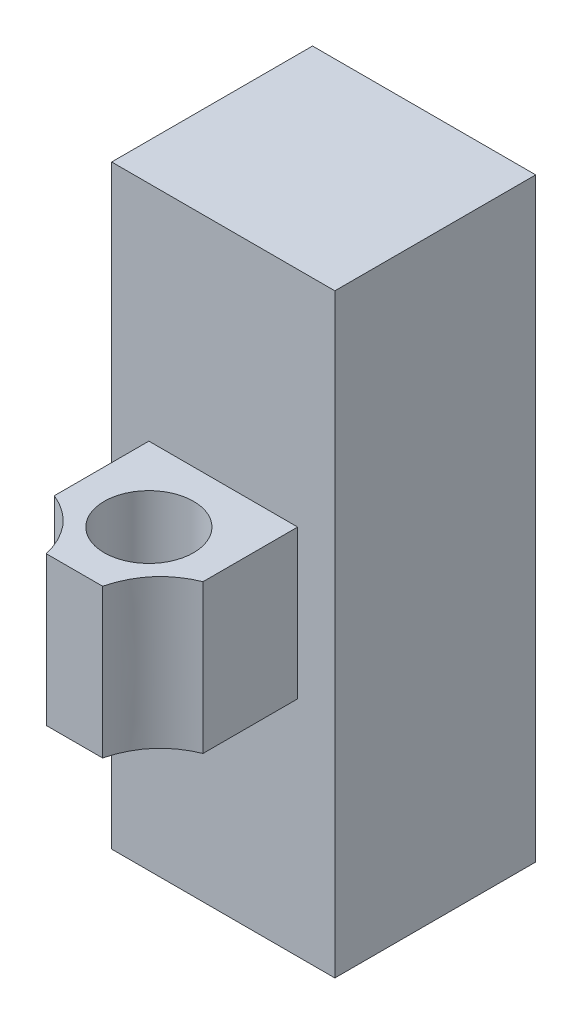
ISO-10303-21;
HEADER;
FILE_DESCRIPTION(('STEP AP214'),'2;1');
FILE_NAME('part.step','',(''),(''),'','','');
FILE_SCHEMA(('AUTOMOTIVE_DESIGN { 1 0 10303 214 1 1 1 1 }'));
ENDSEC;
DATA;
#1=APPLICATION_CONTEXT('core data for automotive mechanical design processes');
#2=APPLICATION_PROTOCOL_DEFINITION('international standard','automotive_design',2000,#1);
#3=PRODUCT_CONTEXT('',#1,'mechanical');
#4=PRODUCT('Part','Part','',(#3));
#5=PRODUCT_RELATED_PRODUCT_CATEGORY('part','',(#4));
#6=PRODUCT_DEFINITION_FORMATION('','',#4);
#7=PRODUCT_DEFINITION_CONTEXT('part definition',#1,'design');
#8=PRODUCT_DEFINITION('design','',#6,#7);
#9=PRODUCT_DEFINITION_SHAPE('','',#8);
#10=(LENGTH_UNIT() NAMED_UNIT(*) SI_UNIT(.MILLI.,.METRE.));
#11=(NAMED_UNIT(*) PLANE_ANGLE_UNIT() SI_UNIT($,.RADIAN.));
#12=(NAMED_UNIT(*) SI_UNIT($,.STERADIAN.) SOLID_ANGLE_UNIT());
#13=UNCERTAINTY_MEASURE_WITH_UNIT(LENGTH_MEASURE(1.E-05),#10,'distance_accuracy_value','');
#14=(GEOMETRIC_REPRESENTATION_CONTEXT(3) GLOBAL_UNCERTAINTY_ASSIGNED_CONTEXT((#13)) GLOBAL_UNIT_ASSIGNED_CONTEXT((#10,
#11,#12)) REPRESENTATION_CONTEXT('',''));
#15=CARTESIAN_POINT('',(0.,0.,0.));
#16=DIRECTION('',(0.,0.,1.));
#17=DIRECTION('',(1.,0.,0.));
#18=AXIS2_PLACEMENT_3D('',#15,#16,#17);
#19=CARTESIAN_POINT('',(10.,-10.,20.));
#20=DIRECTION('',(-1.,0.,0.));
#21=DIRECTION('',(0.,0.,1.));
#22=AXIS2_PLACEMENT_3D('',#19,#20,#21);
#23=PLANE('',#22);
#24=DIRECTION('',(0.,0.,-1.));
#25=VECTOR('',#24,1.);
#26=CARTESIAN_POINT('',(10.,10.,20.));
#27=LINE('',#26,#25);
#28=CARTESIAN_POINT('',(10.,10.,12.7143181142646));
#29=VERTEX_POINT('',#28);
#30=CARTESIAN_POINT('',(10.,10.,0.));
#31=VERTEX_POINT('',#30);
#32=EDGE_CURVE('E11',#29,#31,#27,.T.);
#33=ORIENTED_EDGE('',*,*,#32,.F.);
#34=DIRECTION('',(0.,1.,0.));
#35=VECTOR('',#34,1.);
#36=CARTESIAN_POINT('',(10.,-10.,12.7143181142646));
#37=LINE('',#36,#35);
#38=CARTESIAN_POINT('',(10.,-10.,12.7143181142646));
#39=VERTEX_POINT('',#38);
#40=EDGE_CURVE('E142',#39,#29,#37,.T.);
#41=ORIENTED_EDGE('',*,*,#40,.F.);
#42=DIRECTION('',(0.,0.,-1.));
#43=VECTOR('',#42,1.);
#44=CARTESIAN_POINT('',(10.,-10.,20.));
#45=LINE('',#44,#43);
#46=CARTESIAN_POINT('',(10.,-10.,0.));
#47=VERTEX_POINT('',#46);
#48=EDGE_CURVE('E201',#39,#47,#45,.T.);
#49=ORIENTED_EDGE('',*,*,#48,.T.);
#50=DIRECTION('',(0.,1.,0.));
#51=VECTOR('',#50,1.);
#52=CARTESIAN_POINT('',(10.,-10.,0.));
#53=LINE('',#52,#51);
#54=EDGE_CURVE('E189',#47,#31,#53,.T.);
#55=ORIENTED_EDGE('',*,*,#54,.T.);
#56=EDGE_LOOP('',(#33,#41,#49,#55));
#57=FACE_BOUND('',#56,.T.);
#58=ADVANCED_FACE('F41',(#57),#23,.F.);
#59=CARTESIAN_POINT('',(-10.,10.,20.));
#60=DIRECTION('',(0.,-1.,0.));
#61=DIRECTION('',(0.,0.,-1.));
#62=AXIS2_PLACEMENT_3D('',#59,#60,#61);
#63=PLANE('',#62);
#64=CARTESIAN_POINT('',(0.,10.,10.));
#65=DIRECTION('',(0.,1.,0.));
#66=DIRECTION('',(0.,0.,1.));
#67=AXIS2_PLACEMENT_3D('',#64,#65,#66);
#68=CIRCLE('',#67,6.);
#69=CARTESIAN_POINT('',(0.,10.,16.));
#70=VERTEX_POINT('',#69);
#71=EDGE_CURVE('E190',#70,#70,#68,.T.);
#72=ORIENTED_EDGE('',*,*,#71,.F.);
#73=EDGE_LOOP('',(#72));
#74=FACE_BOUND('',#73,.T.);
#75=DIRECTION('',(0.,0.,-1.));
#76=VECTOR('',#75,1.);
#77=CARTESIAN_POINT('',(-10.,10.,20.));
#78=LINE('',#77,#76);
#79=CARTESIAN_POINT('',(-10.,10.,12.7143181142646));
#80=VERTEX_POINT('',#79);
#81=CARTESIAN_POINT('',(-10.,10.,0.));
#82=VERTEX_POINT('',#81);
#83=EDGE_CURVE('E48',#80,#82,#78,.T.);
#84=ORIENTED_EDGE('',*,*,#83,.F.);
#85=CARTESIAN_POINT('',(-3.78828258809806,10.,20.));
#86=CARTESIAN_POINT('',(-5.11271472694849,10.,14.756625636237));
#87=CARTESIAN_POINT('',(-10.,10.,12.7143181142646));
#88=B_SPLINE_CURVE_WITH_KNOTS('',2,(#85,#86,#87),.UNSPECIFIED.,.F.,.F.,(3,3),(0.,1.),.UNSPECIFIED.);
#89=CARTESIAN_POINT('',(-3.78828258809806,10.,20.));
#90=VERTEX_POINT('',#89);
#91=EDGE_CURVE('E155',#90,#80,#88,.T.);
#92=ORIENTED_EDGE('',*,*,#91,.F.);
#93=DIRECTION('',(-1.,0.,0.));
#94=VECTOR('',#93,1.);
#95=CARTESIAN_POINT('',(-10.,10.,20.));
#96=LINE('',#95,#94);
#97=CARTESIAN_POINT('',(3.78828258809806,10.,20.));
#98=VERTEX_POINT('',#97);
#99=EDGE_CURVE('E194',#98,#90,#96,.T.);
#100=ORIENTED_EDGE('',*,*,#99,.F.);
#101=CARTESIAN_POINT('',(10.,10.,12.7143181142646));
#102=CARTESIAN_POINT('',(5.11271472694849,10.,14.756625636237));
#103=CARTESIAN_POINT('',(3.78828258809807,10.,20.));
#104=B_SPLINE_CURVE_WITH_KNOTS('',2,(#101,#102,#103),.UNSPECIFIED.,.F.,.F.,(3,3),(0.,1.),.UNSPECIFIED.);
#105=EDGE_CURVE('E63',#29,#98,#104,.T.);
#106=ORIENTED_EDGE('',*,*,#105,.F.);
#107=ORIENTED_EDGE('',*,*,#32,.T.);
#108=DIRECTION('',(-1.,0.,0.));
#109=VECTOR('',#108,1.);
#110=CARTESIAN_POINT('',(-10.,10.,0.));
#111=LINE('',#110,#109);
#112=EDGE_CURVE('E204',#31,#82,#111,.T.);
#113=ORIENTED_EDGE('',*,*,#112,.T.);
#114=EDGE_LOOP('',(#84,#92,#100,#106,#107,#113));
#115=FACE_BOUND('',#114,.T.);
#116=ADVANCED_FACE('F224',(#74,#115),#63,.F.);
#117=CARTESIAN_POINT('',(-10.,-10.,20.));
#118=DIRECTION('',(1.,0.,0.));
#119=DIRECTION('',(0.,0.,-1.));
#120=AXIS2_PLACEMENT_3D('',#117,#118,#119);
#121=PLANE('',#120);
#122=DIRECTION('',(0.,0.,-1.));
#123=VECTOR('',#122,1.);
#124=CARTESIAN_POINT('',(-10.,-10.,20.));
#125=LINE('',#124,#123);
#126=CARTESIAN_POINT('',(-10.,-10.,12.7143181142646));
#127=VERTEX_POINT('',#126);
#128=CARTESIAN_POINT('',(-10.,-10.,0.));
#129=VERTEX_POINT('',#128);
#130=EDGE_CURVE('E214',#127,#129,#125,.T.);
#131=ORIENTED_EDGE('',*,*,#130,.F.);
#132=DIRECTION('',(0.,1.,0.));
#133=VECTOR('',#132,1.);
#134=CARTESIAN_POINT('',(-10.,-10.,12.7143181142646));
#135=LINE('',#134,#133);
#136=EDGE_CURVE('E154',#127,#80,#135,.T.);
#137=ORIENTED_EDGE('',*,*,#136,.T.);
#138=ORIENTED_EDGE('',*,*,#83,.T.);
#139=DIRECTION('',(0.,-1.,0.));
#140=VECTOR('',#139,1.);
#141=CARTESIAN_POINT('',(-10.,-10.,0.));
#142=LINE('',#141,#140);
#143=EDGE_CURVE('E207',#82,#129,#142,.T.);
#144=ORIENTED_EDGE('',*,*,#143,.T.);
#145=EDGE_LOOP('',(#131,#137,#138,#144));
#146=FACE_BOUND('',#145,.T.);
#147=ADVANCED_FACE('F221',(#146),#121,.F.);
#148=CARTESIAN_POINT('',(-10.,-10.,20.));
#149=DIRECTION('',(0.,1.,0.));
#150=DIRECTION('',(0.,0.,1.));
#151=AXIS2_PLACEMENT_3D('',#148,#149,#150);
#152=PLANE('',#151);
#153=CARTESIAN_POINT('',(0.,-10.,10.));
#154=DIRECTION('',(0.,1.,0.));
#155=DIRECTION('',(0.,0.,1.));
#156=AXIS2_PLACEMENT_3D('',#153,#154,#155);
#157=CIRCLE('',#156,6.);
#158=CARTESIAN_POINT('',(0.,-10.,16.));
#159=VERTEX_POINT('',#158);
#160=EDGE_CURVE('E183',#159,#159,#157,.T.);
#161=ORIENTED_EDGE('',*,*,#160,.T.);
#162=EDGE_LOOP('',(#161));
#163=FACE_BOUND('',#162,.T.);
#164=DIRECTION('',(1.,0.,0.));
#165=VECTOR('',#164,1.);
#166=CARTESIAN_POINT('',(-10.,-10.,20.));
#167=LINE('',#166,#165);
#168=CARTESIAN_POINT('',(-3.78828258809806,-10.,20.));
#169=VERTEX_POINT('',#168);
#170=CARTESIAN_POINT('',(3.78828258809806,-10.,20.));
#171=VERTEX_POINT('',#170);
#172=EDGE_CURVE('E197',#169,#171,#167,.T.);
#173=ORIENTED_EDGE('',*,*,#172,.F.);
#174=CARTESIAN_POINT('',(-3.78828258809806,-10.,20.));
#175=CARTESIAN_POINT('',(-5.11271472694849,-10.,14.756625636237));
#176=CARTESIAN_POINT('',(-10.,-10.,12.7143181142646));
#177=B_SPLINE_CURVE_WITH_KNOTS('',2,(#174,#175,#176),.UNSPECIFIED.,.F.,.F.,(3,3),(0.,1.),.UNSPECIFIED.);
#178=EDGE_CURVE('E55',#169,#127,#177,.T.);
#179=ORIENTED_EDGE('',*,*,#178,.T.);
#180=ORIENTED_EDGE('',*,*,#130,.T.);
#181=DIRECTION('',(1.,0.,0.));
#182=VECTOR('',#181,1.);
#183=CARTESIAN_POINT('',(-10.,-10.,0.));
#184=LINE('',#183,#182);
#185=EDGE_CURVE('E198',#129,#47,#184,.T.);
#186=ORIENTED_EDGE('',*,*,#185,.T.);
#187=ORIENTED_EDGE('',*,*,#48,.F.);
#188=CARTESIAN_POINT('',(10.,-10.,12.7143181142646));
#189=CARTESIAN_POINT('',(5.11271472694849,-10.,14.756625636237));
#190=CARTESIAN_POINT('',(3.78828258809807,-10.,20.));
#191=B_SPLINE_CURVE_WITH_KNOTS('',2,(#188,#189,#190),.UNSPECIFIED.,.F.,.F.,(3,3),(0.,1.),.UNSPECIFIED.);
#192=EDGE_CURVE('E174',#39,#171,#191,.T.);
#193=ORIENTED_EDGE('',*,*,#192,.T.);
#194=EDGE_LOOP('',(#173,#179,#180,#186,#187,#193));
#195=FACE_BOUND('',#194,.T.);
#196=ADVANCED_FACE('F232',(#163,#195),#152,.F.);
#197=CARTESIAN_POINT('',(0.,0.,20.));
#198=DIRECTION('',(0.,0.,-1.));
#199=DIRECTION('',(-1.,0.,0.));
#200=AXIS2_PLACEMENT_3D('',#197,#198,#199);
#201=PLANE('',#200);
#202=ORIENTED_EDGE('',*,*,#99,.T.);
#203=DIRECTION('',(0.,1.,0.));
#204=VECTOR('',#203,1.);
#205=CARTESIAN_POINT('',(-3.78828258809806,-10.,20.));
#206=LINE('',#205,#204);
#207=EDGE_CURVE('E193',#169,#90,#206,.T.);
#208=ORIENTED_EDGE('',*,*,#207,.F.);
#209=ORIENTED_EDGE('',*,*,#172,.T.);
#210=DIRECTION('',(0.,1.,0.));
#211=VECTOR('',#210,1.);
#212=CARTESIAN_POINT('',(3.78828258809806,-10.,20.));
#213=LINE('',#212,#211);
#214=EDGE_CURVE('E144',#171,#98,#213,.T.);
#215=ORIENTED_EDGE('',*,*,#214,.T.);
#216=EDGE_LOOP('',(#202,#208,#209,#215));
#217=FACE_BOUND('',#216,.T.);
#218=ADVANCED_FACE('F234',(#217),#201,.F.);
#219=CARTESIAN_POINT('',(0.,-10.,10.));
#220=DIRECTION('',(0.,1.,0.));
#221=DIRECTION('',(0.,0.,1.));
#222=AXIS2_PLACEMENT_3D('',#219,#220,#221);
#223=CYLINDRICAL_SURFACE('',#222,6.);
#224=ORIENTED_EDGE('',*,*,#160,.F.);
#225=EDGE_LOOP('',(#224));
#226=FACE_BOUND('',#225,.T.);
#227=ORIENTED_EDGE('',*,*,#71,.T.);
#228=EDGE_LOOP('',(#227));
#229=FACE_BOUND('',#228,.T.);
#230=ADVANCED_FACE('F172',(#226,#229),#223,.F.);
#231=DIRECTION('',(0.,1.,0.));
#232=VECTOR('',#231,1.);
#233=SURFACE_OF_LINEAR_EXTRUSION('',#191,#232);
#234=ORIENTED_EDGE('',*,*,#105,.T.);
#235=ORIENTED_EDGE('',*,*,#214,.F.);
#236=ORIENTED_EDGE('',*,*,#192,.F.);
#237=ORIENTED_EDGE('',*,*,#40,.T.);
#238=EDGE_LOOP('',(#234,#235,#236,#237));
#239=FACE_BOUND('',#238,.T.);
#240=ADVANCED_FACE('F167',(#239),#233,.F.);
#241=DIRECTION('',(0.,1.,0.));
#242=VECTOR('',#241,1.);
#243=SURFACE_OF_LINEAR_EXTRUSION('',#177,#242);
#244=ORIENTED_EDGE('',*,*,#91,.T.);
#245=ORIENTED_EDGE('',*,*,#136,.F.);
#246=ORIENTED_EDGE('',*,*,#178,.F.);
#247=ORIENTED_EDGE('',*,*,#207,.T.);
#248=EDGE_LOOP('',(#244,#245,#246,#247));
#249=FACE_BOUND('',#248,.T.);
#250=ADVANCED_FACE('F163',(#249),#243,.F.);
#251=CARTESIAN_POINT('',(15.,-40.,-27.));
#252=DIRECTION('',(-1.,0.,0.));
#253=DIRECTION('',(0.,0.,1.));
#254=AXIS2_PLACEMENT_3D('',#251,#252,#253);
#255=PLANE('',#254);
#256=DIRECTION('',(0.,-1.,0.));
#257=VECTOR('',#256,1.);
#258=CARTESIAN_POINT('',(15.,-40.,0.));
#259=LINE('',#258,#257);
#260=CARTESIAN_POINT('',(15.,40.,0.));
#261=VERTEX_POINT('',#260);
#262=CARTESIAN_POINT('',(15.,-40.,0.));
#263=VERTEX_POINT('',#262);
#264=EDGE_CURVE('E141',#261,#263,#259,.T.);
#265=ORIENTED_EDGE('',*,*,#264,.T.);
#266=DIRECTION('',(0.,0.,1.));
#267=VECTOR('',#266,1.);
#268=CARTESIAN_POINT('',(15.,-40.,-27.));
#269=LINE('',#268,#267);
#270=CARTESIAN_POINT('',(15.,-40.,-27.));
#271=VERTEX_POINT('',#270);
#272=EDGE_CURVE('E121',#271,#263,#269,.T.);
#273=ORIENTED_EDGE('',*,*,#272,.F.);
#274=DIRECTION('',(0.,-1.,0.));
#275=VECTOR('',#274,1.);
#276=CARTESIAN_POINT('',(15.,-40.,-27.));
#277=LINE('',#276,#275);
#278=CARTESIAN_POINT('',(15.,40.,-27.));
#279=VERTEX_POINT('',#278);
#280=EDGE_CURVE('E128',#279,#271,#277,.T.);
#281=ORIENTED_EDGE('',*,*,#280,.F.);
#282=DIRECTION('',(0.,0.,1.));
#283=VECTOR('',#282,1.);
#284=CARTESIAN_POINT('',(15.,40.,-27.));
#285=LINE('',#284,#283);
#286=EDGE_CURVE('E382',#279,#261,#285,.T.);
#287=ORIENTED_EDGE('',*,*,#286,.T.);
#288=EDGE_LOOP('',(#265,#273,#281,#287));
#289=FACE_BOUND('',#288,.T.);
#290=ADVANCED_FACE('F139',(#289),#255,.F.);
#291=CARTESIAN_POINT('',(-15.,-40.,-27.));
#292=DIRECTION('',(0.,1.,0.));
#293=DIRECTION('',(0.,0.,1.));
#294=AXIS2_PLACEMENT_3D('',#291,#292,#293);
#295=PLANE('',#294);
#296=DIRECTION('',(-1.,0.,0.));
#297=VECTOR('',#296,1.);
#298=CARTESIAN_POINT('',(-15.,-40.,0.));
#299=LINE('',#298,#297);
#300=CARTESIAN_POINT('',(-15.,-40.,0.));
#301=VERTEX_POINT('',#300);
#302=EDGE_CURVE('E388',#263,#301,#299,.T.);
#303=ORIENTED_EDGE('',*,*,#302,.T.);
#304=DIRECTION('',(0.,0.,1.));
#305=VECTOR('',#304,1.);
#306=CARTESIAN_POINT('',(-15.,-40.,-27.));
#307=LINE('',#306,#305);
#308=CARTESIAN_POINT('',(-15.,-40.,-27.));
#309=VERTEX_POINT('',#308);
#310=EDGE_CURVE('E124',#309,#301,#307,.T.);
#311=ORIENTED_EDGE('',*,*,#310,.F.);
#312=DIRECTION('',(-1.,0.,0.));
#313=VECTOR('',#312,1.);
#314=CARTESIAN_POINT('',(-15.,-40.,-27.));
#315=LINE('',#314,#313);
#316=EDGE_CURVE('E117',#271,#309,#315,.T.);
#317=ORIENTED_EDGE('',*,*,#316,.F.);
#318=ORIENTED_EDGE('',*,*,#272,.T.);
#319=EDGE_LOOP('',(#303,#311,#317,#318));
#320=FACE_BOUND('',#319,.T.);
#321=ADVANCED_FACE('F119',(#320),#295,.F.);
#322=CARTESIAN_POINT('',(-15.,-40.,-27.));
#323=DIRECTION('',(1.,0.,0.));
#324=DIRECTION('',(0.,0.,-1.));
#325=AXIS2_PLACEMENT_3D('',#322,#323,#324);
#326=PLANE('',#325);
#327=DIRECTION('',(0.,1.,0.));
#328=VECTOR('',#327,1.);
#329=CARTESIAN_POINT('',(-15.,-40.,0.));
#330=LINE('',#329,#328);
#331=CARTESIAN_POINT('',(-15.,40.,0.));
#332=VERTEX_POINT('',#331);
#333=EDGE_CURVE('E385',#301,#332,#330,.T.);
#334=ORIENTED_EDGE('',*,*,#333,.T.);
#335=DIRECTION('',(0.,0.,1.));
#336=VECTOR('',#335,1.);
#337=CARTESIAN_POINT('',(-15.,40.,-27.));
#338=LINE('',#337,#336);
#339=CARTESIAN_POINT('',(-15.,40.,-27.));
#340=VERTEX_POINT('',#339);
#341=EDGE_CURVE('E146',#340,#332,#338,.T.);
#342=ORIENTED_EDGE('',*,*,#341,.F.);
#343=DIRECTION('',(0.,1.,0.));
#344=VECTOR('',#343,1.);
#345=CARTESIAN_POINT('',(-15.,-40.,-27.));
#346=LINE('',#345,#344);
#347=EDGE_CURVE('E127',#309,#340,#346,.T.);
#348=ORIENTED_EDGE('',*,*,#347,.F.);
#349=ORIENTED_EDGE('',*,*,#310,.T.);
#350=EDGE_LOOP('',(#334,#342,#348,#349));
#351=FACE_BOUND('',#350,.T.);
#352=ADVANCED_FACE('F282',(#351),#326,.F.);
#353=CARTESIAN_POINT('',(-15.,40.,-27.));
#354=DIRECTION('',(0.,-1.,0.));
#355=DIRECTION('',(0.,0.,-1.));
#356=AXIS2_PLACEMENT_3D('',#353,#354,#355);
#357=PLANE('',#356);
#358=DIRECTION('',(1.,0.,0.));
#359=VECTOR('',#358,1.);
#360=CARTESIAN_POINT('',(-15.,40.,0.));
#361=LINE('',#360,#359);
#362=EDGE_CURVE('E137',#332,#261,#361,.T.);
#363=ORIENTED_EDGE('',*,*,#362,.T.);
#364=ORIENTED_EDGE('',*,*,#286,.F.);
#365=DIRECTION('',(1.,0.,0.));
#366=VECTOR('',#365,1.);
#367=CARTESIAN_POINT('',(-15.,40.,-27.));
#368=LINE('',#367,#366);
#369=EDGE_CURVE('E133',#340,#279,#368,.T.);
#370=ORIENTED_EDGE('',*,*,#369,.F.);
#371=ORIENTED_EDGE('',*,*,#341,.T.);
#372=EDGE_LOOP('',(#363,#364,#370,#371));
#373=FACE_BOUND('',#372,.T.);
#374=ADVANCED_FACE('F288',(#373),#357,.F.);
#375=CARTESIAN_POINT('',(0.,0.,-27.));
#376=DIRECTION('',(0.,0.,-1.));
#377=DIRECTION('',(-1.,0.,0.));
#378=AXIS2_PLACEMENT_3D('',#375,#376,#377);
#379=PLANE('',#378);
#380=ORIENTED_EDGE('',*,*,#280,.T.);
#381=ORIENTED_EDGE('',*,*,#316,.T.);
#382=ORIENTED_EDGE('',*,*,#347,.T.);
#383=ORIENTED_EDGE('',*,*,#369,.T.);
#384=EDGE_LOOP('',(#380,#381,#382,#383));
#385=FACE_BOUND('',#384,.T.);
#386=ADVANCED_FACE('F131',(#385),#379,.T.);
#387=CARTESIAN_POINT('',(0.,0.,0.));
#388=DIRECTION('',(0.,0.,-1.));
#389=DIRECTION('',(-1.,0.,0.));
#390=AXIS2_PLACEMENT_3D('',#387,#388,#389);
#391=PLANE('',#390);
#392=ORIENTED_EDGE('',*,*,#54,.F.);
#393=ORIENTED_EDGE('',*,*,#185,.F.);
#394=ORIENTED_EDGE('',*,*,#143,.F.);
#395=ORIENTED_EDGE('',*,*,#112,.F.);
#396=EDGE_LOOP('',(#392,#393,#394,#395));
#397=FACE_BOUND('',#396,.T.);
#398=ORIENTED_EDGE('',*,*,#264,.F.);
#399=ORIENTED_EDGE('',*,*,#362,.F.);
#400=ORIENTED_EDGE('',*,*,#333,.F.);
#401=ORIENTED_EDGE('',*,*,#302,.F.);
#402=EDGE_LOOP('',(#398,#399,#400,#401));
#403=FACE_BOUND('',#402,.T.);
#404=ADVANCED_FACE('F227',(#397,#403),#391,.F.);
#405=CLOSED_SHELL('',(#58,#116,#147,#196,#218,#230,#240,#250,#290,#321,#352,#374,#386,#404));
#406=MANIFOLD_SOLID_BREP('B2',#405);
#407=ADVANCED_BREP_SHAPE_REPRESENTATION('',(#18,#406),#14);
#408=SHAPE_DEFINITION_REPRESENTATION(#9,#407);
ENDSEC;
END-ISO-10303-21;
